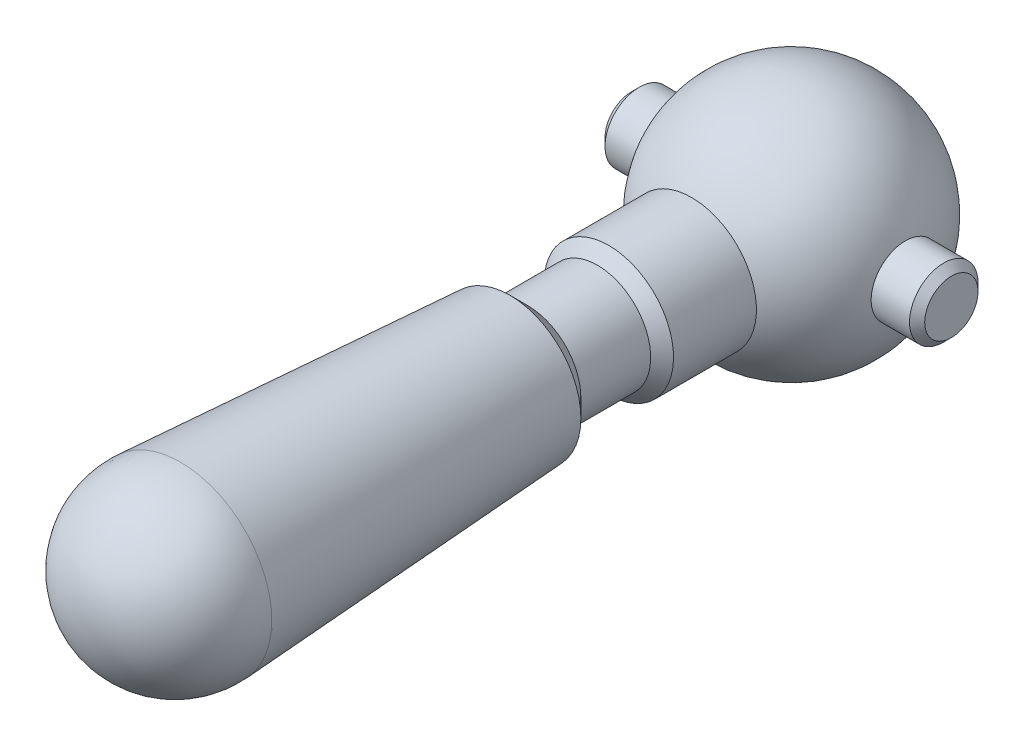
ISO-10303-21;
HEADER;
FILE_DESCRIPTION(('STEP AP214'),'2;1');
FILE_NAME('part.step','',(''),(''),'','','');
FILE_SCHEMA(('AUTOMOTIVE_DESIGN { 1 0 10303 214 1 1 1 1 }'));
ENDSEC;
DATA;
#1=APPLICATION_CONTEXT('core data for automotive mechanical design processes');
#2=APPLICATION_PROTOCOL_DEFINITION('international standard','automotive_design',2000,#1);
#3=PRODUCT_CONTEXT('',#1,'mechanical');
#4=PRODUCT('Part','Part','',(#3));
#5=PRODUCT_RELATED_PRODUCT_CATEGORY('part','',(#4));
#6=PRODUCT_DEFINITION_FORMATION('','',#4);
#7=PRODUCT_DEFINITION_CONTEXT('part definition',#1,'design');
#8=PRODUCT_DEFINITION('design','',#6,#7);
#9=PRODUCT_DEFINITION_SHAPE('','',#8);
#10=(LENGTH_UNIT() NAMED_UNIT(*) SI_UNIT(.MILLI.,.METRE.));
#11=(NAMED_UNIT(*) PLANE_ANGLE_UNIT() SI_UNIT($,.RADIAN.));
#12=(NAMED_UNIT(*) SI_UNIT($,.STERADIAN.) SOLID_ANGLE_UNIT());
#13=UNCERTAINTY_MEASURE_WITH_UNIT(LENGTH_MEASURE(1.E-05),#10,'distance_accuracy_value','');
#14=(GEOMETRIC_REPRESENTATION_CONTEXT(3) GLOBAL_UNCERTAINTY_ASSIGNED_CONTEXT((#13)) GLOBAL_UNIT_ASSIGNED_CONTEXT((#10,
#11,#12)) REPRESENTATION_CONTEXT('',''));
#15=CARTESIAN_POINT('',(0.,0.,0.));
#16=DIRECTION('',(0.,0.,1.));
#17=DIRECTION('',(1.,0.,0.));
#18=AXIS2_PLACEMENT_3D('',#15,#16,#17);
#19=CARTESIAN_POINT('',(-5.334,0.,5.842));
#20=DIRECTION('',(1.,0.,0.));
#21=DIRECTION('',(0.,0.,-1.));
#22=AXIS2_PLACEMENT_3D('',#19,#20,#21);
#23=PLANE('',#22);
#24=CARTESIAN_POINT('',(-5.33399999989115,0.,5.842));
#25=DIRECTION('',(1.,0.,0.));
#26=DIRECTION('',(0.,0.,-1.));
#27=AXIS2_PLACEMENT_3D('',#24,#25,#26);
#28=CIRCLE('',#27,0.888999999972384);
#29=CARTESIAN_POINT('',(-5.33399999989115,0.,4.95300000002762));
#30=VERTEX_POINT('',#29);
#31=EDGE_CURVE('E19',#30,#30,#28,.T.);
#32=ORIENTED_EDGE('',*,*,#31,.F.);
#33=EDGE_LOOP('',(#32));
#34=FACE_BOUND('',#33,.T.);
#35=ADVANCED_FACE('F16',(#34),#23,.F.);
#36=CARTESIAN_POINT('',(5.334,0.,5.842));
#37=DIRECTION('',(1.,0.,0.));
#38=DIRECTION('',(0.,0.,-1.));
#39=AXIS2_PLACEMENT_3D('',#36,#37,#38);
#40=PLANE('',#39);
#41=CARTESIAN_POINT('',(5.33399999989115,0.,5.842));
#42=DIRECTION('',(-1.,0.,0.));
#43=DIRECTION('',(0.,0.,1.));
#44=AXIS2_PLACEMENT_3D('',#41,#42,#43);
#45=CIRCLE('',#44,0.888999999972384);
#46=CARTESIAN_POINT('',(5.33399999989115,0.,6.73099999997238));
#47=VERTEX_POINT('',#46);
#48=EDGE_CURVE('E93',#47,#47,#45,.T.);
#49=ORIENTED_EDGE('',*,*,#48,.F.);
#50=EDGE_LOOP('',(#49));
#51=FACE_BOUND('',#50,.T.);
#52=ADVANCED_FACE('F106',(#51),#40,.T.);
#53=CARTESIAN_POINT('',(-5.07999999990716,0.,5.842));
#54=DIRECTION('',(1.,0.,0.));
#55=DIRECTION('',(0.,0.,-1.));
#56=AXIS2_PLACEMENT_3D('',#53,#54,#55);
#57=CONICAL_SURFACE('',#56,1.14299999995637,0.785398163397449);
#58=CARTESIAN_POINT('',(-5.08,0.,5.842));
#59=DIRECTION('',(1.,0.,0.));
#60=DIRECTION('',(0.,0.,-1.));
#61=AXIS2_PLACEMENT_3D('',#58,#59,#60);
#62=CIRCLE('',#61,1.143);
#63=CARTESIAN_POINT('',(-5.08,0.,4.699));
#64=VERTEX_POINT('',#63);
#65=EDGE_CURVE('E91',#64,#64,#62,.T.);
#66=ORIENTED_EDGE('',*,*,#65,.F.);
#67=EDGE_LOOP('',(#66));
#68=FACE_BOUND('',#67,.T.);
#69=ORIENTED_EDGE('',*,*,#31,.T.);
#70=EDGE_LOOP('',(#69));
#71=FACE_BOUND('',#70,.T.);
#72=ADVANCED_FACE('F103',(#68,#71),#57,.T.);
#73=CARTESIAN_POINT('',(5.07999999990716,0.,5.842));
#74=DIRECTION('',(-1.,0.,0.));
#75=DIRECTION('',(0.,0.,1.));
#76=AXIS2_PLACEMENT_3D('',#73,#74,#75);
#77=CONICAL_SURFACE('',#76,1.14299999995637,0.785398163397449);
#78=CARTESIAN_POINT('',(5.08,0.,5.842));
#79=DIRECTION('',(1.,0.,0.));
#80=DIRECTION('',(0.,0.,-1.));
#81=AXIS2_PLACEMENT_3D('',#78,#79,#80);
#82=CIRCLE('',#81,1.143);
#83=CARTESIAN_POINT('',(5.08,0.,4.699));
#84=VERTEX_POINT('',#83);
#85=EDGE_CURVE('E88',#84,#84,#82,.F.);
#86=ORIENTED_EDGE('',*,*,#85,.F.);
#87=EDGE_LOOP('',(#86));
#88=FACE_BOUND('',#87,.T.);
#89=ORIENTED_EDGE('',*,*,#48,.T.);
#90=EDGE_LOOP('',(#89));
#91=FACE_BOUND('',#90,.T.);
#92=ADVANCED_FACE('F115',(#88,#91),#77,.T.);
#93=CARTESIAN_POINT('',(0.,0.,5.842));
#94=DIRECTION('',(1.,0.,0.));
#95=DIRECTION('',(0.,0.,-1.));
#96=AXIS2_PLACEMENT_3D('',#93,#94,#95);
#97=CYLINDRICAL_SURFACE('',#96,1.143);
#98=ORIENTED_EDGE('',*,*,#65,.T.);
#99=EDGE_LOOP('',(#98));
#100=FACE_BOUND('',#99,.T.);
#101=CARTESIAN_POINT('',(-3.80059568521873,0.,5.842));
#102=DIRECTION('',(1.,0.,0.));
#103=DIRECTION('',(0.,1.,0.));
#104=AXIS2_PLACEMENT_3D('',#101,#102,#103);
#105=CIRCLE('',#104,1.143);
#106=CARTESIAN_POINT('',(-3.80059568521873,1.143,5.842));
#107=VERTEX_POINT('',#106);
#108=EDGE_CURVE('E85',#107,#107,#105,.T.);
#109=ORIENTED_EDGE('',*,*,#108,.F.);
#110=EDGE_LOOP('',(#109));
#111=FACE_BOUND('',#110,.T.);
#112=ADVANCED_FACE('F120',(#100,#111),#97,.T.);
#113=CARTESIAN_POINT('',(0.,0.,5.842));
#114=DIRECTION('',(1.,0.,0.));
#115=DIRECTION('',(0.,0.,-1.));
#116=AXIS2_PLACEMENT_3D('',#113,#114,#115);
#117=CYLINDRICAL_SURFACE('',#116,1.143);
#118=CARTESIAN_POINT('',(3.80059568521873,0.,5.842));
#119=DIRECTION('',(1.,0.,0.));
#120=DIRECTION('',(0.,1.,0.));
#121=AXIS2_PLACEMENT_3D('',#118,#119,#120);
#122=CIRCLE('',#121,1.143);
#123=CARTESIAN_POINT('',(3.80059568521873,1.143,5.842));
#124=VERTEX_POINT('',#123);
#125=EDGE_CURVE('E81',#124,#124,#122,.F.);
#126=ORIENTED_EDGE('',*,*,#125,.F.);
#127=EDGE_LOOP('',(#126));
#128=FACE_BOUND('',#127,.T.);
#129=ORIENTED_EDGE('',*,*,#85,.T.);
#130=EDGE_LOOP('',(#129));
#131=FACE_BOUND('',#130,.T.);
#132=ADVANCED_FACE('F73',(#128,#131),#117,.T.);
#133=CARTESIAN_POINT('',(0.,0.,5.842));
#134=DIRECTION('',(1.,0.,0.));
#135=DIRECTION('',(0.,1.,0.));
#136=AXIS2_PLACEMENT_3D('',#133,#134,#135);
#137=SPHERICAL_SURFACE('',#136,3.96875000000041);
#138=ORIENTED_EDGE('',*,*,#108,.T.);
#139=EDGE_LOOP('',(#138));
#140=FACE_BOUND('',#139,.T.);
#141=CARTESIAN_POINT('',(0.,0.,9.17211945168684));
#142=DIRECTION('',(0.,0.,-1.));
#143=DIRECTION('',(-1.,0.,0.));
#144=AXIS2_PLACEMENT_3D('',#141,#142,#143);
#145=CIRCLE('',#144,2.159);
#146=CARTESIAN_POINT('',(-2.159,0.,9.17211945168684));
#147=VERTEX_POINT('',#146);
#148=EDGE_CURVE('E84',#147,#147,#145,.F.);
#149=ORIENTED_EDGE('',*,*,#148,.F.);
#150=EDGE_LOOP('',(#149));
#151=FACE_BOUND('',#150,.T.);
#152=ORIENTED_EDGE('',*,*,#125,.T.);
#153=EDGE_LOOP('',(#152));
#154=FACE_BOUND('',#153,.T.);
#155=ADVANCED_FACE('F68',(#140,#151,#154),#137,.T.);
#156=CARTESIAN_POINT('',(0.,0.,10.5550597258434));
#157=DIRECTION('',(0.,0.,-1.));
#158=DIRECTION('',(-1.,0.,0.));
#159=AXIS2_PLACEMENT_3D('',#156,#157,#158);
#160=CYLINDRICAL_SURFACE('',#159,2.159);
#161=CARTESIAN_POINT('',(0.,0.,11.9380000000433));
#162=DIRECTION('',(0.,0.,-1.));
#163=DIRECTION('',(0.,1.,0.));
#164=AXIS2_PLACEMENT_3D('',#161,#162,#163);
#165=CIRCLE('',#164,2.15900000000602);
#166=CARTESIAN_POINT('',(0.,2.15900000000602,11.9380000000433));
#167=VERTEX_POINT('',#166);
#168=EDGE_CURVE('E96',#167,#167,#165,.F.);
#169=ORIENTED_EDGE('',*,*,#168,.F.);
#170=EDGE_LOOP('',(#169));
#171=FACE_BOUND('',#170,.T.);
#172=ORIENTED_EDGE('',*,*,#148,.T.);
#173=EDGE_LOOP('',(#172));
#174=FACE_BOUND('',#173,.T.);
#175=ADVANCED_FACE('F64',(#171,#174),#160,.T.);
#176=CARTESIAN_POINT('',(0.,0.,11.938000000157));
#177=DIRECTION('',(0.,0.,-1.));
#178=DIRECTION('',(-1.,0.,0.));
#179=AXIS2_PLACEMENT_3D('',#176,#177,#178);
#180=CONICAL_SURFACE('',#179,2.15899999983549,0.785398163397449);
#181=CARTESIAN_POINT('',(0.,0.,12.319));
#182=DIRECTION('',(0.,0.,-1.));
#183=DIRECTION('',(-1.,0.,0.));
#184=AXIS2_PLACEMENT_3D('',#181,#182,#183);
#185=CIRCLE('',#184,1.778);
#186=CARTESIAN_POINT('',(-1.778,0.,12.319));
#187=VERTEX_POINT('',#186);
#188=EDGE_CURVE('E48',#187,#187,#185,.F.);
#189=ORIENTED_EDGE('',*,*,#188,.F.);
#190=EDGE_LOOP('',(#189));
#191=FACE_BOUND('',#190,.T.);
#192=ORIENTED_EDGE('',*,*,#168,.T.);
#193=EDGE_LOOP('',(#192));
#194=FACE_BOUND('',#193,.T.);
#195=ADVANCED_FACE('F60',(#191,#194),#180,.T.);
#196=CARTESIAN_POINT('',(0.,0.,13.4834288423273));
#197=DIRECTION('',(0.,0.,-1.));
#198=DIRECTION('',(-1.,0.,0.));
#199=AXIS2_PLACEMENT_3D('',#196,#197,#198);
#200=CYLINDRICAL_SURFACE('',#199,1.778);
#201=CARTESIAN_POINT('',(0.,0.,14.6478576846789));
#202=DIRECTION('',(0.,0.,1.));
#203=DIRECTION('',(0.,1.,0.));
#204=AXIS2_PLACEMENT_3D('',#201,#202,#203);
#205=CIRCLE('',#204,1.77800000000161);
#206=CARTESIAN_POINT('',(0.,1.77800000000161,14.6478576846789));
#207=VERTEX_POINT('',#206);
#208=EDGE_CURVE('E45',#207,#207,#205,.T.);
#209=ORIENTED_EDGE('',*,*,#208,.F.);
#210=EDGE_LOOP('',(#209));
#211=FACE_BOUND('',#210,.T.);
#212=ORIENTED_EDGE('',*,*,#188,.T.);
#213=EDGE_LOOP('',(#212));
#214=FACE_BOUND('',#213,.T.);
#215=ADVANCED_FACE('F57',(#211,#214),#200,.T.);
#216=CARTESIAN_POINT('',(0.,0.,15.2400000000625));
#217=DIRECTION('',(0.,0.,1.));
#218=DIRECTION('',(1.,0.,0.));
#219=AXIS2_PLACEMENT_3D('',#216,#217,#218);
#220=CONICAL_SURFACE('',#219,2.37014231532839,0.78539816334945);
#221=CARTESIAN_POINT('',(0.,0.,15.2400000000057));
#222=DIRECTION('',(0.,0.,1.));
#223=DIRECTION('',(0.,1.,0.));
#224=AXIS2_PLACEMENT_3D('',#221,#222,#223);
#225=CIRCLE('',#224,2.37014231534616);
#226=CARTESIAN_POINT('',(0.,2.37014231534616,15.2400000000057));
#227=VERTEX_POINT('',#226);
#228=EDGE_CURVE('E25',#227,#227,#225,.T.);
#229=ORIENTED_EDGE('',*,*,#228,.F.);
#230=EDGE_LOOP('',(#229));
#231=FACE_BOUND('',#230,.T.);
#232=ORIENTED_EDGE('',*,*,#208,.T.);
#233=EDGE_LOOP('',(#232));
#234=FACE_BOUND('',#233,.T.);
#235=ADVANCED_FACE('F35',(#231,#234),#220,.T.);
#236=CARTESIAN_POINT('',(0.,0.,26.416));
#237=DIRECTION('',(1.,0.,0.));
#238=DIRECTION('',(0.,1.,0.));
#239=AXIS2_PLACEMENT_3D('',#236,#237,#238);
#240=SPHERICAL_SURFACE('',#239,3.048);
#241=CARTESIAN_POINT('',(-3.048,0.,26.416));
#242=VERTEX_POINT('',#241);
#243=VERTEX_LOOP('',#242);
#244=FACE_BOUND('',#243,.T.);
#245=CARTESIAN_POINT('',(0.,0.,26.2299240515063));
#246=DIRECTION('',(0.,0.,1.));
#247=DIRECTION('',(1.,0.,0.));
#248=AXIS2_PLACEMENT_3D('',#245,#246,#247);
#249=CIRCLE('',#248,3.04231486559196);
#250=CARTESIAN_POINT('',(3.04231486559196,0.,26.2299240515063));
#251=VERTEX_POINT('',#250);
#252=EDGE_CURVE('E11',#251,#251,#249,.F.);
#253=ORIENTED_EDGE('',*,*,#252,.F.);
#254=EDGE_LOOP('',(#253));
#255=FACE_BOUND('',#254,.T.);
#256=CARTESIAN_POINT('',(3.048,0.,26.416));
#257=VERTEX_POINT('',#256);
#258=VERTEX_LOOP('',#257);
#259=FACE_BOUND('',#258,.T.);
#260=ADVANCED_FACE('F31',(#244,#255,#259),#240,.T.);
#261=CARTESIAN_POINT('',(0.,0.,26.2299240514494));
#262=DIRECTION('',(0.,0.,1.));
#263=DIRECTION('',(1.,0.,0.));
#264=AXIS2_PLACEMENT_3D('',#261,#262,#263);
#265=CONICAL_SURFACE('',#264,3.04231486558848,0.0610865238199171);
#266=ORIENTED_EDGE('',*,*,#252,.T.);
#267=EDGE_LOOP('',(#266));
#268=FACE_BOUND('',#267,.T.);
#269=ORIENTED_EDGE('',*,*,#228,.T.);
#270=EDGE_LOOP('',(#269));
#271=FACE_BOUND('',#270,.T.);
#272=ADVANCED_FACE('F34',(#268,#271),#265,.T.);
#273=CLOSED_SHELL('',(#35,#52,#72,#92,#112,#132,#155,#175,#195,#215,#235,#260,#272));
#274=MANIFOLD_SOLID_BREP('B1',#273);
#275=ADVANCED_BREP_SHAPE_REPRESENTATION('',(#18,#274),#14);
#276=SHAPE_DEFINITION_REPRESENTATION(#9,#275);
ENDSEC;
END-ISO-10303-21;
